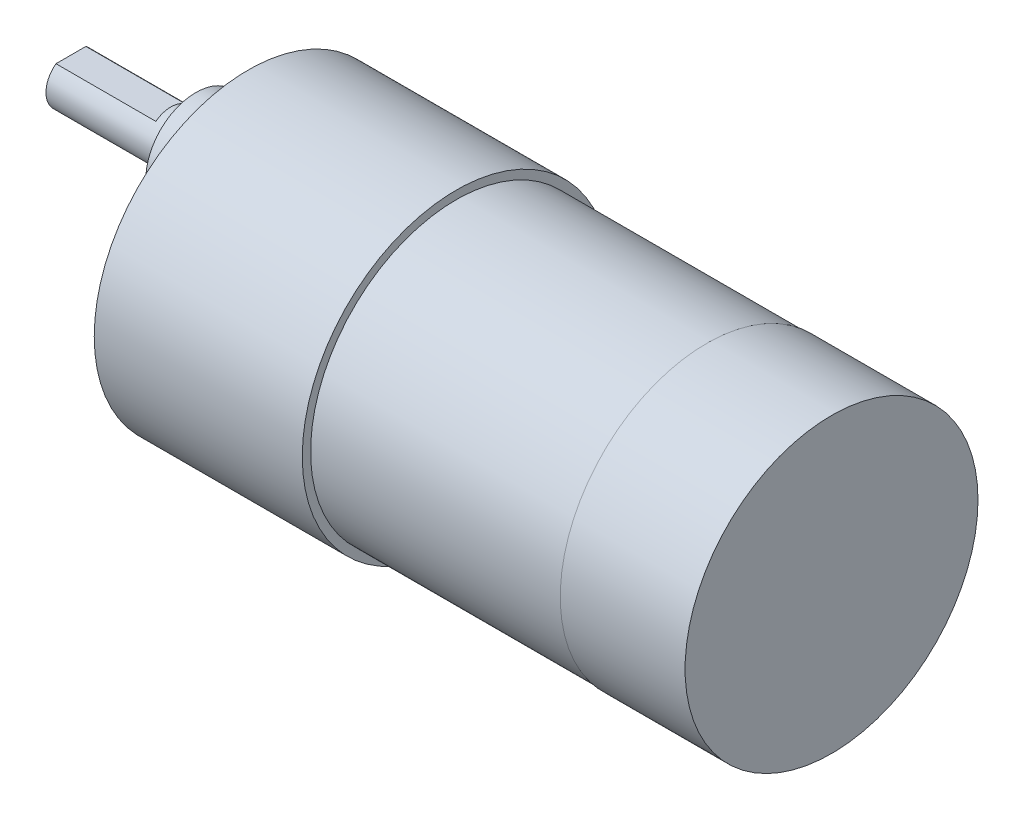
ISO-10303-21;
HEADER;
FILE_DESCRIPTION(('STEP AP214'),'2;1');
FILE_NAME('part.step','',(''),(''),'','','');
FILE_SCHEMA(('AUTOMOTIVE_DESIGN { 1 0 10303 214 1 1 1 1 }'));
ENDSEC;
DATA;
#1=APPLICATION_CONTEXT('core data for automotive mechanical design processes');
#2=APPLICATION_PROTOCOL_DEFINITION('international standard','automotive_design',2000,#1);
#3=PRODUCT_CONTEXT('',#1,'mechanical');
#4=PRODUCT('Part','Part','',(#3));
#5=PRODUCT_RELATED_PRODUCT_CATEGORY('part','',(#4));
#6=PRODUCT_DEFINITION_FORMATION('','',#4);
#7=PRODUCT_DEFINITION_CONTEXT('part definition',#1,'design');
#8=PRODUCT_DEFINITION('design','',#6,#7);
#9=PRODUCT_DEFINITION_SHAPE('','',#8);
#10=(LENGTH_UNIT() NAMED_UNIT(*) SI_UNIT(.MILLI.,.METRE.));
#11=(NAMED_UNIT(*) PLANE_ANGLE_UNIT() SI_UNIT($,.RADIAN.));
#12=(NAMED_UNIT(*) SI_UNIT($,.STERADIAN.) SOLID_ANGLE_UNIT());
#13=UNCERTAINTY_MEASURE_WITH_UNIT(LENGTH_MEASURE(1.E-05),#10,'distance_accuracy_value','');
#14=(GEOMETRIC_REPRESENTATION_CONTEXT(3) GLOBAL_UNCERTAINTY_ASSIGNED_CONTEXT((#13)) GLOBAL_UNIT_ASSIGNED_CONTEXT((#10,
#11,#12)) REPRESENTATION_CONTEXT('',''));
#15=CARTESIAN_POINT('',(0.,0.,0.));
#16=DIRECTION('',(0.,0.,1.));
#17=DIRECTION('',(1.,0.,0.));
#18=AXIS2_PLACEMENT_3D('',#15,#16,#17);
#19=CARTESIAN_POINT('',(204.237955952687,-13.875,0.));
#20=DIRECTION('',(1.,0.,0.));
#21=DIRECTION('',(0.,0.,-1.));
#22=AXIS2_PLACEMENT_3D('',#19,#20,#21);
#23=CYLINDRICAL_SURFACE('',#22,17.6);
#24=CARTESIAN_POINT('',(204.237955952687,-13.875,0.));
#25=DIRECTION('',(1.,0.,0.));
#26=DIRECTION('',(0.,0.,-1.));
#27=AXIS2_PLACEMENT_3D('',#24,#25,#26);
#28=CIRCLE('',#27,17.6);
#29=CARTESIAN_POINT('',(204.237955952687,-13.875,-17.6));
#30=VERTEX_POINT('',#29);
#31=EDGE_CURVE('E12',#30,#30,#28,.T.);
#32=ORIENTED_EDGE('',*,*,#31,.T.);
#33=EDGE_LOOP('',(#32));
#34=FACE_BOUND('',#33,.T.);
#35=CARTESIAN_POINT('',(219.237955952687,-13.875,0.));
#36=DIRECTION('',(1.,0.,0.));
#37=DIRECTION('',(0.,0.,-1.));
#38=AXIS2_PLACEMENT_3D('',#35,#36,#37);
#39=CIRCLE('',#38,17.6);
#40=CARTESIAN_POINT('',(219.237955952687,-13.875,-17.6));
#41=VERTEX_POINT('',#40);
#42=EDGE_CURVE('E47',#41,#41,#39,.T.);
#43=ORIENTED_EDGE('',*,*,#42,.F.);
#44=EDGE_LOOP('',(#43));
#45=FACE_BOUND('',#44,.T.);
#46=ADVANCED_FACE('F44',(#34,#45),#23,.T.);
#47=CARTESIAN_POINT('',(204.237955952687,-13.875,0.));
#48=DIRECTION('',(1.,0.,0.));
#49=DIRECTION('',(0.,0.,-1.));
#50=AXIS2_PLACEMENT_3D('',#47,#48,#49);
#51=PLANE('',#50);
#52=ORIENTED_EDGE('',*,*,#31,.F.);
#53=EDGE_LOOP('',(#52));
#54=FACE_BOUND('',#53,.T.);
#55=ADVANCED_FACE('F59',(#54),#51,.F.);
#56=CARTESIAN_POINT('',(219.237955952687,-13.875,0.));
#57=DIRECTION('',(1.,0.,0.));
#58=DIRECTION('',(0.,0.,-1.));
#59=AXIS2_PLACEMENT_3D('',#56,#57,#58);
#60=PLANE('',#59);
#61=ORIENTED_EDGE('',*,*,#42,.T.);
#62=EDGE_LOOP('',(#61));
#63=FACE_BOUND('',#62,.T.);
#64=ADVANCED_FACE('F56',(#63),#60,.T.);
#65=CLOSED_SHELL('',(#46,#55,#64));
#66=MANIFOLD_SOLID_BREP('B2',#65);
#67=CARTESIAN_POINT('',(219.137955952687,-13.875,0.));
#68=DIRECTION('',(-1.,0.,0.));
#69=DIRECTION('',(0.,0.,1.));
#70=AXIS2_PLACEMENT_3D('',#67,#68,#69);
#71=CYLINDRICAL_SURFACE('',#70,18.5);
#72=CARTESIAN_POINT('',(149.137955952687,-13.875,0.));
#73=DIRECTION('',(1.,0.,0.));
#74=DIRECTION('',(0.,0.,-1.));
#75=AXIS2_PLACEMENT_3D('',#72,#73,#74);
#76=CIRCLE('',#75,18.5);
#77=CARTESIAN_POINT('',(149.137955952687,-13.875,-18.5));
#78=VERTEX_POINT('',#77);
#79=EDGE_CURVE('E93',#78,#78,#76,.T.);
#80=ORIENTED_EDGE('',*,*,#79,.T.);
#81=EDGE_LOOP('',(#80));
#82=FACE_BOUND('',#81,.T.);
#83=CARTESIAN_POINT('',(174.137955952687,-13.875,0.));
#84=DIRECTION('',(1.,0.,0.));
#85=DIRECTION('',(0.,0.,-1.));
#86=AXIS2_PLACEMENT_3D('',#83,#84,#85);
#87=CIRCLE('',#86,18.5);
#88=CARTESIAN_POINT('',(174.137955952687,-13.875,-18.5));
#89=VERTEX_POINT('',#88);
#90=EDGE_CURVE('E88',#89,#89,#87,.T.);
#91=ORIENTED_EDGE('',*,*,#90,.F.);
#92=EDGE_LOOP('',(#91));
#93=FACE_BOUND('',#92,.T.);
#94=ADVANCED_FACE('F85',(#82,#93),#71,.T.);
#95=CARTESIAN_POINT('',(149.137955952687,-13.875,0.));
#96=DIRECTION('',(1.,0.,0.));
#97=DIRECTION('',(0.,0.,-1.));
#98=AXIS2_PLACEMENT_3D('',#95,#96,#97);
#99=PLANE('',#98);
#100=CARTESIAN_POINT('',(149.137955952687,-13.875,-15.5));
#101=DIRECTION('',(-1.,0.,0.));
#102=DIRECTION('',(0.,0.,1.));
#103=AXIS2_PLACEMENT_3D('',#100,#101,#102);
#104=CIRCLE('',#103,1.5);
#105=CARTESIAN_POINT('',(149.137955952687,-13.875,-14.));
#106=VERTEX_POINT('',#105);
#107=EDGE_CURVE('E257',#106,#106,#104,.T.);
#108=ORIENTED_EDGE('',*,*,#107,.F.);
#109=EDGE_LOOP('',(#108));
#110=FACE_BOUND('',#109,.T.);
#111=CARTESIAN_POINT('',(149.137955952687,-0.451606241341201,-7.74999999999999));
#112=DIRECTION('',(-1.,0.,0.));
#113=DIRECTION('',(0.,0.,1.));
#114=AXIS2_PLACEMENT_3D('',#111,#112,#113);
#115=CIRCLE('',#114,1.5);
#116=CARTESIAN_POINT('',(149.137955952687,-0.451606241341201,-6.24999999999999));
#117=VERTEX_POINT('',#116);
#118=EDGE_CURVE('E251',#117,#117,#115,.T.);
#119=ORIENTED_EDGE('',*,*,#118,.F.);
#120=EDGE_LOOP('',(#119));
#121=FACE_BOUND('',#120,.T.);
#122=CARTESIAN_POINT('',(149.137955952687,-0.451606241341213,7.75000000000001));
#123=DIRECTION('',(-1.,0.,0.));
#124=DIRECTION('',(0.,0.,1.));
#125=AXIS2_PLACEMENT_3D('',#122,#123,#124);
#126=CIRCLE('',#125,1.5);
#127=CARTESIAN_POINT('',(149.137955952687,-0.451606241341213,9.25000000000001));
#128=VERTEX_POINT('',#127);
#129=EDGE_CURVE('E245',#128,#128,#126,.T.);
#130=ORIENTED_EDGE('',*,*,#129,.F.);
#131=EDGE_LOOP('',(#130));
#132=FACE_BOUND('',#131,.T.);
#133=CARTESIAN_POINT('',(149.137955952687,-13.875,15.5));
#134=DIRECTION('',(-1.,0.,0.));
#135=DIRECTION('',(0.,0.,1.));
#136=AXIS2_PLACEMENT_3D('',#133,#134,#135);
#137=CIRCLE('',#136,1.5);
#138=CARTESIAN_POINT('',(149.137955952687,-13.875,17.));
#139=VERTEX_POINT('',#138);
#140=EDGE_CURVE('E244',#139,#139,#137,.T.);
#141=ORIENTED_EDGE('',*,*,#140,.F.);
#142=EDGE_LOOP('',(#141));
#143=FACE_BOUND('',#142,.T.);
#144=CARTESIAN_POINT('',(149.137955952687,-27.2983937586588,7.75));
#145=DIRECTION('',(-1.,0.,0.));
#146=DIRECTION('',(0.,0.,1.));
#147=AXIS2_PLACEMENT_3D('',#144,#145,#146);
#148=CIRCLE('',#147,1.5);
#149=CARTESIAN_POINT('',(149.137955952687,-27.2983937586588,9.25));
#150=VERTEX_POINT('',#149);
#151=EDGE_CURVE('E263',#150,#150,#148,.T.);
#152=ORIENTED_EDGE('',*,*,#151,.F.);
#153=EDGE_LOOP('',(#152));
#154=FACE_BOUND('',#153,.T.);
#155=CARTESIAN_POINT('',(149.137955952687,-27.2983937586588,-7.75));
#156=DIRECTION('',(-1.,0.,0.));
#157=DIRECTION('',(0.,0.,1.));
#158=AXIS2_PLACEMENT_3D('',#155,#156,#157);
#159=CIRCLE('',#158,1.5);
#160=CARTESIAN_POINT('',(149.137955952687,-27.2983937586588,-6.25));
#161=VERTEX_POINT('',#160);
#162=EDGE_CURVE('E135',#161,#161,#159,.T.);
#163=ORIENTED_EDGE('',*,*,#162,.F.);
#164=EDGE_LOOP('',(#163));
#165=FACE_BOUND('',#164,.T.);
#166=CARTESIAN_POINT('',(149.137955952687,-6.875,0.));
#167=DIRECTION('',(1.,0.,0.));
#168=DIRECTION('',(0.,0.,-1.));
#169=AXIS2_PLACEMENT_3D('',#166,#167,#168);
#170=CIRCLE('',#169,6.);
#171=CARTESIAN_POINT('',(149.137955952687,-6.875,-6.));
#172=VERTEX_POINT('',#171);
#173=EDGE_CURVE('E42',#172,#172,#170,.F.);
#174=ORIENTED_EDGE('',*,*,#173,.F.);
#175=EDGE_LOOP('',(#174));
#176=FACE_BOUND('',#175,.T.);
#177=ORIENTED_EDGE('',*,*,#79,.F.);
#178=EDGE_LOOP('',(#177));
#179=FACE_BOUND('',#178,.T.);
#180=ADVANCED_FACE('F143',(#110,#121,#132,#143,#154,#165,#176,#179),#99,.F.);
#181=CARTESIAN_POINT('',(142.837955952687,-6.875,0.));
#182=DIRECTION('',(1.,0.,0.));
#183=DIRECTION('',(0.,0.,-1.));
#184=AXIS2_PLACEMENT_3D('',#181,#182,#183);
#185=CYLINDRICAL_SURFACE('',#184,6.);
#186=CARTESIAN_POINT('',(142.837955952687,-6.875,0.));
#187=DIRECTION('',(-1.,0.,0.));
#188=DIRECTION('',(0.,0.,1.));
#189=AXIS2_PLACEMENT_3D('',#186,#187,#188);
#190=CIRCLE('',#189,6.);
#191=CARTESIAN_POINT('',(142.837955952687,-6.875,-6.));
#192=VERTEX_POINT('',#191);
#193=EDGE_CURVE('E126',#192,#192,#190,.T.);
#194=CARTESIAN_POINT('',(142.837955952687,-6.875,-6.));
#195=CARTESIAN_POINT('',(142.903580952687,-6.875,-6.));
#196=CARTESIAN_POINT('',(142.969205952687,-6.875,-6.));
#197=CARTESIAN_POINT('',(143.100455952687,-6.875,-6.));
#198=CARTESIAN_POINT('',(143.166080952687,-6.875,-6.));
#199=CARTESIAN_POINT('',(143.297330952687,-6.875,-6.));
#200=CARTESIAN_POINT('',(143.362955952687,-6.875,-6.));
#201=CARTESIAN_POINT('',(143.494205952687,-6.875,-6.));
#202=CARTESIAN_POINT('',(143.559830952687,-6.875,-6.));
#203=CARTESIAN_POINT('',(143.691080952687,-6.875,-6.));
#204=CARTESIAN_POINT('',(143.756705952687,-6.875,-6.));
#205=CARTESIAN_POINT('',(143.887955952687,-6.875,-6.));
#206=CARTESIAN_POINT('',(143.953580952687,-6.875,-6.));
#207=CARTESIAN_POINT('',(144.084830952687,-6.875,-6.));
#208=CARTESIAN_POINT('',(144.150455952687,-6.875,-6.));
#209=CARTESIAN_POINT('',(144.281705952687,-6.875,-6.));
#210=CARTESIAN_POINT('',(144.347330952687,-6.875,-6.));
#211=CARTESIAN_POINT('',(144.478580952687,-6.875,-6.));
#212=CARTESIAN_POINT('',(144.544205952687,-6.875,-6.));
#213=CARTESIAN_POINT('',(144.675455952687,-6.875,-6.));
#214=CARTESIAN_POINT('',(144.741080952687,-6.875,-6.));
#215=CARTESIAN_POINT('',(144.872330952687,-6.875,-6.));
#216=CARTESIAN_POINT('',(144.937955952687,-6.875,-6.));
#217=CARTESIAN_POINT('',(145.069205952687,-6.875,-6.));
#218=CARTESIAN_POINT('',(145.134830952687,-6.875,-6.));
#219=CARTESIAN_POINT('',(145.266080952687,-6.875,-6.));
#220=CARTESIAN_POINT('',(145.331705952687,-6.875,-6.));
#221=CARTESIAN_POINT('',(145.462955952687,-6.875,-6.));
#222=CARTESIAN_POINT('',(145.528580952687,-6.875,-6.));
#223=CARTESIAN_POINT('',(145.659830952687,-6.875,-6.));
#224=CARTESIAN_POINT('',(145.725455952687,-6.875,-6.));
#225=CARTESIAN_POINT('',(145.856705952687,-6.875,-6.));
#226=CARTESIAN_POINT('',(145.922330952687,-6.875,-6.));
#227=CARTESIAN_POINT('',(146.053580952687,-6.875,-6.));
#228=CARTESIAN_POINT('',(146.119205952687,-6.875,-6.));
#229=CARTESIAN_POINT('',(146.250455952687,-6.875,-6.));
#230=CARTESIAN_POINT('',(146.316080952687,-6.875,-6.));
#231=CARTESIAN_POINT('',(146.447330952687,-6.875,-6.));
#232=CARTESIAN_POINT('',(146.512955952687,-6.875,-6.));
#233=CARTESIAN_POINT('',(146.644205952687,-6.875,-6.));
#234=CARTESIAN_POINT('',(146.709830952687,-6.875,-6.));
#235=CARTESIAN_POINT('',(146.841080952687,-6.875,-6.));
#236=CARTESIAN_POINT('',(146.906705952687,-6.875,-6.));
#237=CARTESIAN_POINT('',(147.037955952687,-6.875,-6.));
#238=CARTESIAN_POINT('',(147.103580952687,-6.875,-6.));
#239=CARTESIAN_POINT('',(147.234830952687,-6.875,-6.));
#240=CARTESIAN_POINT('',(147.300455952687,-6.875,-6.));
#241=CARTESIAN_POINT('',(147.431705952687,-6.875,-6.));
#242=CARTESIAN_POINT('',(147.497330952687,-6.875,-6.));
#243=CARTESIAN_POINT('',(147.628580952687,-6.875,-6.));
#244=CARTESIAN_POINT('',(147.694205952687,-6.875,-6.));
#245=CARTESIAN_POINT('',(147.825455952687,-6.875,-6.));
#246=CARTESIAN_POINT('',(147.891080952687,-6.875,-6.));
#247=CARTESIAN_POINT('',(148.022330952687,-6.875,-6.));
#248=CARTESIAN_POINT('',(148.087955952687,-6.875,-6.));
#249=CARTESIAN_POINT('',(148.219205952687,-6.875,-6.));
#250=CARTESIAN_POINT('',(148.284830952687,-6.875,-6.));
#251=CARTESIAN_POINT('',(148.416080952687,-6.875,-6.));
#252=CARTESIAN_POINT('',(148.481705952687,-6.875,-6.));
#253=CARTESIAN_POINT('',(148.612955952687,-6.875,-6.));
#254=CARTESIAN_POINT('',(148.678580952687,-6.875,-6.));
#255=CARTESIAN_POINT('',(148.809830952687,-6.875,-6.));
#256=CARTESIAN_POINT('',(148.875455952687,-6.875,-6.));
#257=CARTESIAN_POINT('',(149.006705952687,-6.875,-6.));
#258=CARTESIAN_POINT('',(149.072330952687,-6.875,-6.));
#259=CARTESIAN_POINT('',(149.137955952687,-6.875,-6.));
#260=B_SPLINE_CURVE_WITH_KNOTS('',3,(#194,#195,#196,#197,#198,#199,#200,#201,#202,#203,#204,
#205,#206,#207,#208,#209,#210,#211,#212,#213,#214,#215,#216,#217,#218,#219,#220,#221,#222,#223,
#224,#225,#226,#227,#228,#229,#230,#231,#232,#233,#234,#235,#236,#237,#238,#239,#240,#241,#242,
#243,#244,#245,#246,#247,#248,#249,#250,#251,#252,#253,#254,#255,#256,#257,#258,#259),
.UNSPECIFIED.,.F.,.F.,(4,2,2,2,2,2,2,2,2,2,2,2,2,2,2,2,2,2,2,2,2,2,2,2,2,2,2,2,2,2,2,2,4),(0.,
0.196875000000013,0.393749999999998,0.590625000000011,0.787499999999997,0.98437500000001,
1.18124999999999,1.37812500000001,1.57499999999999,1.77187500000001,1.96874999999999,2.165625,
2.36249999999999,2.559375,2.75624999999999,2.953125,3.14999999999999,3.34687499999997,
3.54374999999998,3.74062499999997,3.93749999999998,4.13437499999997,4.33124999999998,
4.52812499999997,4.72499999999998,4.92187499999996,5.11874999999998,5.31562499999996,
5.51249999999998,5.70937499999996,5.90624999999997,6.10312499999996,6.29999999999994),.UNSPECIFIED.);
#261=EDGE_CURVE('BSEAM145',#192,#172,#260,.T.);
#262=ORIENTED_EDGE('',*,*,#193,.F.);
#263=ORIENTED_EDGE('',*,*,#173,.T.);
#264=ORIENTED_EDGE('',*,*,#261,.T.);
#265=ORIENTED_EDGE('',*,*,#261,.F.);
#266=EDGE_LOOP('',(#262,#264,#263,#265));
#267=FACE_BOUND('',#266,.T.);
#268=ADVANCED_FACE('F145',(#267),#185,.T.);
#269=CARTESIAN_POINT('',(142.837955952687,-6.875,0.));
#270=DIRECTION('',(-1.,0.,0.));
#271=DIRECTION('',(0.,0.,1.));
#272=AXIS2_PLACEMENT_3D('',#269,#270,#271);
#273=PLANE('',#272);
#274=CARTESIAN_POINT('',(142.837955952687,-6.875,0.));
#275=DIRECTION('',(-1.,0.,0.));
#276=DIRECTION('',(0.,0.,1.));
#277=AXIS2_PLACEMENT_3D('',#274,#275,#276);
#278=CIRCLE('',#277,3.00000000000016);
#279=CARTESIAN_POINT('',(142.837955952687,-6.875,3.00000000000016));
#280=VERTEX_POINT('',#279);
#281=EDGE_CURVE('E127',#280,#280,#278,.T.);
#282=ORIENTED_EDGE('',*,*,#281,.F.);
#283=EDGE_LOOP('',(#282));
#284=FACE_BOUND('',#283,.T.);
#285=ORIENTED_EDGE('',*,*,#193,.T.);
#286=EDGE_LOOP('',(#285));
#287=FACE_BOUND('',#286,.T.);
#288=ADVANCED_FACE('F151',(#284,#287),#273,.T.);
#289=CARTESIAN_POINT('',(127.837955952687,-6.875,0.));
#290=DIRECTION('',(1.,0.,0.));
#291=DIRECTION('',(0.,0.,-1.));
#292=AXIS2_PLACEMENT_3D('',#289,#290,#291);
#293=CYLINDRICAL_SURFACE('',#292,3.00000000000016);
#294=CARTESIAN_POINT('',(127.837955952687,-6.875,0.));
#295=DIRECTION('',(-1.,0.,0.));
#296=DIRECTION('',(0.,0.,1.));
#297=AXIS2_PLACEMENT_3D('',#294,#295,#296);
#298=CIRCLE('',#297,3.00000000000016);
#299=CARTESIAN_POINT('',(127.837955952687,-4.47500000000017,-1.80000000000049));
#300=VERTEX_POINT('',#299);
#301=CARTESIAN_POINT('',(127.837955952687,-4.47500000000017,1.80000000000049));
#302=VERTEX_POINT('',#301);
#303=EDGE_CURVE('E122',#300,#302,#298,.T.);
#304=ORIENTED_EDGE('',*,*,#303,.F.);
#305=DIRECTION('',(-1.,0.,0.));
#306=VECTOR('',#305,1.);
#307=CARTESIAN_POINT('',(139.837955952687,-4.47500000000017,-1.80000000000049));
#308=LINE('',#307,#306);
#309=CARTESIAN_POINT('',(139.837955952687,-4.47500000000017,-1.80000000000049));
#310=VERTEX_POINT('',#309);
#311=EDGE_CURVE('E100',#310,#300,#308,.T.);
#312=ORIENTED_EDGE('',*,*,#311,.F.);
#313=CARTESIAN_POINT('',(139.837955952687,-6.875,0.));
#314=DIRECTION('',(-1.,0.,0.));
#315=DIRECTION('',(0.,0.,1.));
#316=AXIS2_PLACEMENT_3D('',#313,#314,#315);
#317=CIRCLE('',#316,3.00000000000016);
#318=CARTESIAN_POINT('',(139.837955952687,-4.47500000000017,1.80000000000049));
#319=VERTEX_POINT('',#318);
#320=EDGE_CURVE('E116',#319,#310,#317,.T.);
#321=ORIENTED_EDGE('',*,*,#320,.F.);
#322=DIRECTION('',(-1.,0.,0.));
#323=VECTOR('',#322,1.);
#324=CARTESIAN_POINT('',(139.837955952687,-4.47500000000017,1.80000000000049));
#325=LINE('',#324,#323);
#326=EDGE_CURVE('E106',#319,#302,#325,.T.);
#327=ORIENTED_EDGE('',*,*,#326,.T.);
#328=EDGE_LOOP('',(#304,#312,#321,#327));
#329=FACE_BOUND('',#328,.T.);
#330=ORIENTED_EDGE('',*,*,#281,.T.);
#331=EDGE_LOOP('',(#330));
#332=FACE_BOUND('',#331,.T.);
#333=ADVANCED_FACE('F120',(#329,#332),#293,.T.);
#334=CARTESIAN_POINT('',(127.837955952687,-6.875,0.));
#335=DIRECTION('',(-1.,0.,0.));
#336=DIRECTION('',(0.,0.,1.));
#337=AXIS2_PLACEMENT_3D('',#334,#335,#336);
#338=PLANE('',#337);
#339=DIRECTION('',(0.,0.,1.));
#340=VECTOR('',#339,1.);
#341=CARTESIAN_POINT('',(127.837955952687,-4.47500000000017,0.));
#342=LINE('',#341,#340);
#343=EDGE_CURVE('E111',#300,#302,#342,.T.);
#344=ORIENTED_EDGE('',*,*,#343,.F.);
#345=ORIENTED_EDGE('',*,*,#303,.T.);
#346=EDGE_LOOP('',(#344,#345));
#347=FACE_BOUND('',#346,.T.);
#348=ADVANCED_FACE('F125',(#347),#338,.T.);
#349=CARTESIAN_POINT('',(169.137955952687,-27.2983937586588,-7.75));
#350=DIRECTION('',(-1.,0.,0.));
#351=DIRECTION('',(0.,0.,1.));
#352=AXIS2_PLACEMENT_3D('',#349,#350,#351);
#353=CYLINDRICAL_SURFACE('',#352,1.5);
#354=CARTESIAN_POINT('',(169.137955952687,-27.2983937586588,-7.75));
#355=DIRECTION('',(-1.,0.,0.));
#356=DIRECTION('',(0.,0.,1.));
#357=AXIS2_PLACEMENT_3D('',#354,#355,#356);
#358=CIRCLE('',#357,1.5);
#359=CARTESIAN_POINT('',(169.137955952687,-27.2983937586588,-6.25));
#360=VERTEX_POINT('',#359);
#361=EDGE_CURVE('E132',#360,#360,#358,.T.);
#362=ORIENTED_EDGE('',*,*,#361,.F.);
#363=EDGE_LOOP('',(#362));
#364=FACE_BOUND('',#363,.T.);
#365=ORIENTED_EDGE('',*,*,#162,.T.);
#366=EDGE_LOOP('',(#365));
#367=FACE_BOUND('',#366,.T.);
#368=ADVANCED_FACE('F169',(#364,#367),#353,.F.);
#369=CARTESIAN_POINT('',(169.137955952687,-27.2983937586588,-7.75));
#370=DIRECTION('',(-1.,0.,0.));
#371=DIRECTION('',(0.,0.,1.));
#372=AXIS2_PLACEMENT_3D('',#369,#370,#371);
#373=PLANE('',#372);
#374=ORIENTED_EDGE('',*,*,#361,.T.);
#375=EDGE_LOOP('',(#374));
#376=FACE_BOUND('',#375,.T.);
#377=ADVANCED_FACE('F172',(#376),#373,.T.);
#378=CARTESIAN_POINT('',(169.137955952687,-27.2983937586588,7.75));
#379=DIRECTION('',(-1.,0.,0.));
#380=DIRECTION('',(0.,0.,1.));
#381=AXIS2_PLACEMENT_3D('',#378,#379,#380);
#382=CYLINDRICAL_SURFACE('',#381,1.5);
#383=CARTESIAN_POINT('',(169.137955952687,-27.2983937586588,7.75));
#384=DIRECTION('',(-1.,0.,0.));
#385=DIRECTION('',(0.,0.,1.));
#386=AXIS2_PLACEMENT_3D('',#383,#384,#385);
#387=CIRCLE('',#386,1.5);
#388=CARTESIAN_POINT('',(169.137955952687,-27.2983937586588,9.25));
#389=VERTEX_POINT('',#388);
#390=EDGE_CURVE('E260',#389,#389,#387,.T.);
#391=ORIENTED_EDGE('',*,*,#390,.F.);
#392=EDGE_LOOP('',(#391));
#393=FACE_BOUND('',#392,.T.);
#394=ORIENTED_EDGE('',*,*,#151,.T.);
#395=EDGE_LOOP('',(#394));
#396=FACE_BOUND('',#395,.T.);
#397=ADVANCED_FACE('F176',(#393,#396),#382,.F.);
#398=CARTESIAN_POINT('',(169.137955952687,-27.2983937586588,7.75));
#399=DIRECTION('',(-1.,0.,0.));
#400=DIRECTION('',(0.,0.,1.));
#401=AXIS2_PLACEMENT_3D('',#398,#399,#400);
#402=PLANE('',#401);
#403=ORIENTED_EDGE('',*,*,#390,.T.);
#404=EDGE_LOOP('',(#403));
#405=FACE_BOUND('',#404,.T.);
#406=ADVANCED_FACE('F182',(#405),#402,.T.);
#407=CARTESIAN_POINT('',(169.137955952687,-13.875,15.5));
#408=DIRECTION('',(-1.,0.,0.));
#409=DIRECTION('',(0.,0.,1.));
#410=AXIS2_PLACEMENT_3D('',#407,#408,#409);
#411=CYLINDRICAL_SURFACE('',#410,1.5);
#412=CARTESIAN_POINT('',(169.137955952687,-13.875,15.5));
#413=DIRECTION('',(-1.,0.,0.));
#414=DIRECTION('',(0.,0.,1.));
#415=AXIS2_PLACEMENT_3D('',#412,#413,#414);
#416=CIRCLE('',#415,1.5);
#417=CARTESIAN_POINT('',(169.137955952687,-13.875,17.));
#418=VERTEX_POINT('',#417);
#419=EDGE_CURVE('E266',#418,#418,#416,.T.);
#420=ORIENTED_EDGE('',*,*,#419,.F.);
#421=EDGE_LOOP('',(#420));
#422=FACE_BOUND('',#421,.T.);
#423=ORIENTED_EDGE('',*,*,#140,.T.);
#424=EDGE_LOOP('',(#423));
#425=FACE_BOUND('',#424,.T.);
#426=ADVANCED_FACE('F178',(#422,#425),#411,.F.);
#427=CARTESIAN_POINT('',(169.137955952687,-13.875,15.5));
#428=DIRECTION('',(-1.,0.,0.));
#429=DIRECTION('',(0.,0.,1.));
#430=AXIS2_PLACEMENT_3D('',#427,#428,#429);
#431=PLANE('',#430);
#432=ORIENTED_EDGE('',*,*,#419,.T.);
#433=EDGE_LOOP('',(#432));
#434=FACE_BOUND('',#433,.T.);
#435=ADVANCED_FACE('F181',(#434),#431,.T.);
#436=CARTESIAN_POINT('',(169.137955952687,-0.451606241341213,7.75000000000001));
#437=DIRECTION('',(-1.,0.,0.));
#438=DIRECTION('',(0.,0.,1.));
#439=AXIS2_PLACEMENT_3D('',#436,#437,#438);
#440=CYLINDRICAL_SURFACE('',#439,1.5);
#441=CARTESIAN_POINT('',(169.137955952687,-0.451606241341213,7.75000000000001));
#442=DIRECTION('',(-1.,0.,0.));
#443=DIRECTION('',(0.,0.,1.));
#444=AXIS2_PLACEMENT_3D('',#441,#442,#443);
#445=CIRCLE('',#444,1.5);
#446=CARTESIAN_POINT('',(169.137955952687,-0.451606241341213,9.25000000000001));
#447=VERTEX_POINT('',#446);
#448=EDGE_CURVE('E241',#447,#447,#445,.T.);
#449=ORIENTED_EDGE('',*,*,#448,.F.);
#450=EDGE_LOOP('',(#449));
#451=FACE_BOUND('',#450,.T.);
#452=ORIENTED_EDGE('',*,*,#129,.T.);
#453=EDGE_LOOP('',(#452));
#454=FACE_BOUND('',#453,.T.);
#455=ADVANCED_FACE('F186',(#451,#454),#440,.F.);
#456=CARTESIAN_POINT('',(169.137955952687,-0.451606241341213,7.75000000000001));
#457=DIRECTION('',(-1.,0.,0.));
#458=DIRECTION('',(0.,0.,1.));
#459=AXIS2_PLACEMENT_3D('',#456,#457,#458);
#460=PLANE('',#459);
#461=ORIENTED_EDGE('',*,*,#448,.T.);
#462=EDGE_LOOP('',(#461));
#463=FACE_BOUND('',#462,.T.);
#464=ADVANCED_FACE('F207',(#463),#460,.T.);
#465=CARTESIAN_POINT('',(169.137955952687,-0.451606241341201,-7.74999999999999));
#466=DIRECTION('',(-1.,0.,0.));
#467=DIRECTION('',(0.,0.,1.));
#468=AXIS2_PLACEMENT_3D('',#465,#466,#467);
#469=CYLINDRICAL_SURFACE('',#468,1.5);
#470=CARTESIAN_POINT('',(169.137955952687,-0.451606241341201,-7.74999999999999));
#471=DIRECTION('',(-1.,0.,0.));
#472=DIRECTION('',(0.,0.,1.));
#473=AXIS2_PLACEMENT_3D('',#470,#471,#472);
#474=CIRCLE('',#473,1.5);
#475=CARTESIAN_POINT('',(169.137955952687,-0.451606241341201,-6.24999999999999));
#476=VERTEX_POINT('',#475);
#477=EDGE_CURVE('E248',#476,#476,#474,.T.);
#478=ORIENTED_EDGE('',*,*,#477,.F.);
#479=EDGE_LOOP('',(#478));
#480=FACE_BOUND('',#479,.T.);
#481=ORIENTED_EDGE('',*,*,#118,.T.);
#482=EDGE_LOOP('',(#481));
#483=FACE_BOUND('',#482,.T.);
#484=ADVANCED_FACE('F204',(#480,#483),#469,.F.);
#485=CARTESIAN_POINT('',(169.137955952687,-0.451606241341201,-7.74999999999999));
#486=DIRECTION('',(-1.,0.,0.));
#487=DIRECTION('',(0.,0.,1.));
#488=AXIS2_PLACEMENT_3D('',#485,#486,#487);
#489=PLANE('',#488);
#490=ORIENTED_EDGE('',*,*,#477,.T.);
#491=EDGE_LOOP('',(#490));
#492=FACE_BOUND('',#491,.T.);
#493=ADVANCED_FACE('F198',(#492),#489,.T.);
#494=CARTESIAN_POINT('',(169.137955952687,-13.875,-15.5));
#495=DIRECTION('',(-1.,0.,0.));
#496=DIRECTION('',(0.,0.,1.));
#497=AXIS2_PLACEMENT_3D('',#494,#495,#496);
#498=CYLINDRICAL_SURFACE('',#497,1.5);
#499=CARTESIAN_POINT('',(169.137955952687,-13.875,-15.5));
#500=DIRECTION('',(-1.,0.,0.));
#501=DIRECTION('',(0.,0.,1.));
#502=AXIS2_PLACEMENT_3D('',#499,#500,#501);
#503=CIRCLE('',#502,1.5);
#504=CARTESIAN_POINT('',(169.137955952687,-13.875,-14.));
#505=VERTEX_POINT('',#504);
#506=EDGE_CURVE('E254',#505,#505,#503,.T.);
#507=ORIENTED_EDGE('',*,*,#506,.F.);
#508=EDGE_LOOP('',(#507));
#509=FACE_BOUND('',#508,.T.);
#510=ORIENTED_EDGE('',*,*,#107,.T.);
#511=EDGE_LOOP('',(#510));
#512=FACE_BOUND('',#511,.T.);
#513=ADVANCED_FACE('F194',(#509,#512),#498,.F.);
#514=CARTESIAN_POINT('',(169.137955952687,-13.875,-15.5));
#515=DIRECTION('',(-1.,0.,0.));
#516=DIRECTION('',(0.,0.,1.));
#517=AXIS2_PLACEMENT_3D('',#514,#515,#516);
#518=PLANE('',#517);
#519=ORIENTED_EDGE('',*,*,#506,.T.);
#520=EDGE_LOOP('',(#519));
#521=FACE_BOUND('',#520,.T.);
#522=ADVANCED_FACE('F197',(#521),#518,.T.);
#523=CARTESIAN_POINT('',(174.137955952687,-13.875,0.));
#524=DIRECTION('',(1.,0.,0.));
#525=DIRECTION('',(0.,0.,-1.));
#526=AXIS2_PLACEMENT_3D('',#523,#524,#525);
#527=PLANE('',#526);
#528=CARTESIAN_POINT('',(174.137955952687,-13.875,0.));
#529=DIRECTION('',(1.,0.,0.));
#530=DIRECTION('',(0.,0.,-1.));
#531=AXIS2_PLACEMENT_3D('',#528,#529,#530);
#532=CIRCLE('',#531,17.5);
#533=CARTESIAN_POINT('',(174.137955952687,-13.875,-17.5));
#534=VERTEX_POINT('',#533);
#535=EDGE_CURVE('E236',#534,#534,#532,.T.);
#536=ORIENTED_EDGE('',*,*,#535,.F.);
#537=EDGE_LOOP('',(#536));
#538=FACE_BOUND('',#537,.T.);
#539=ORIENTED_EDGE('',*,*,#90,.T.);
#540=EDGE_LOOP('',(#539));
#541=FACE_BOUND('',#540,.T.);
#542=ADVANCED_FACE('F202',(#538,#541),#527,.T.);
#543=CARTESIAN_POINT('',(174.137955952687,-13.875,0.));
#544=DIRECTION('',(1.,0.,0.));
#545=DIRECTION('',(0.,0.,-1.));
#546=AXIS2_PLACEMENT_3D('',#543,#544,#545);
#547=CYLINDRICAL_SURFACE('',#546,17.5);
#548=CARTESIAN_POINT('',(219.137955952687,-13.875,0.));
#549=DIRECTION('',(1.,0.,0.));
#550=DIRECTION('',(0.,0.,-1.));
#551=AXIS2_PLACEMENT_3D('',#548,#549,#550);
#552=CIRCLE('',#551,17.5);
#553=CARTESIAN_POINT('',(219.137955952687,-13.875,-17.5));
#554=VERTEX_POINT('',#553);
#555=EDGE_CURVE('E123',#554,#554,#552,.T.);
#556=CARTESIAN_POINT('',(174.137955952687,-13.875,-17.5));
#557=CARTESIAN_POINT('',(174.606705952687,-13.875,-17.5));
#558=CARTESIAN_POINT('',(175.075455952687,-13.875,-17.5));
#559=CARTESIAN_POINT('',(176.012955952687,-13.875,-17.5));
#560=CARTESIAN_POINT('',(176.481705952687,-13.875,-17.5));
#561=CARTESIAN_POINT('',(177.419205952687,-13.875,-17.5));
#562=CARTESIAN_POINT('',(177.887955952687,-13.875,-17.5));
#563=CARTESIAN_POINT('',(178.825455952687,-13.875,-17.5));
#564=CARTESIAN_POINT('',(179.294205952687,-13.875,-17.5));
#565=CARTESIAN_POINT('',(180.231705952687,-13.875,-17.5));
#566=CARTESIAN_POINT('',(180.700455952687,-13.875,-17.5));
#567=CARTESIAN_POINT('',(181.637955952687,-13.875,-17.5));
#568=CARTESIAN_POINT('',(182.106705952687,-13.875,-17.5));
#569=CARTESIAN_POINT('',(183.044205952687,-13.875,-17.5));
#570=CARTESIAN_POINT('',(183.512955952687,-13.875,-17.5));
#571=CARTESIAN_POINT('',(184.450455952687,-13.875,-17.5));
#572=CARTESIAN_POINT('',(184.919205952687,-13.875,-17.5));
#573=CARTESIAN_POINT('',(185.856705952687,-13.875,-17.5));
#574=CARTESIAN_POINT('',(186.325455952687,-13.875,-17.5));
#575=CARTESIAN_POINT('',(187.262955952687,-13.875,-17.5));
#576=CARTESIAN_POINT('',(187.731705952687,-13.875,-17.5));
#577=CARTESIAN_POINT('',(188.669205952687,-13.875,-17.5));
#578=CARTESIAN_POINT('',(189.137955952687,-13.875,-17.5));
#579=CARTESIAN_POINT('',(190.075455952687,-13.875,-17.5));
#580=CARTESIAN_POINT('',(190.544205952687,-13.875,-17.5));
#581=CARTESIAN_POINT('',(191.481705952687,-13.875,-17.5));
#582=CARTESIAN_POINT('',(191.950455952687,-13.875,-17.5));
#583=CARTESIAN_POINT('',(192.887955952687,-13.875,-17.5));
#584=CARTESIAN_POINT('',(193.356705952687,-13.875,-17.5));
#585=CARTESIAN_POINT('',(194.294205952687,-13.875,-17.5));
#586=CARTESIAN_POINT('',(194.762955952687,-13.875,-17.5));
#587=CARTESIAN_POINT('',(195.700455952687,-13.875,-17.5));
#588=CARTESIAN_POINT('',(196.169205952687,-13.875,-17.5));
#589=CARTESIAN_POINT('',(197.106705952687,-13.875,-17.5));
#590=CARTESIAN_POINT('',(197.575455952687,-13.875,-17.5));
#591=CARTESIAN_POINT('',(198.512955952687,-13.875,-17.5));
#592=CARTESIAN_POINT('',(198.981705952687,-13.875,-17.5));
#593=CARTESIAN_POINT('',(199.919205952687,-13.875,-17.5));
#594=CARTESIAN_POINT('',(200.387955952687,-13.875,-17.5));
#595=CARTESIAN_POINT('',(201.325455952687,-13.875,-17.5));
#596=CARTESIAN_POINT('',(201.794205952687,-13.875,-17.5));
#597=CARTESIAN_POINT('',(202.731705952687,-13.875,-17.5));
#598=CARTESIAN_POINT('',(203.200455952687,-13.875,-17.5));
#599=CARTESIAN_POINT('',(204.137955952687,-13.875,-17.5));
#600=CARTESIAN_POINT('',(204.606705952687,-13.875,-17.5));
#601=CARTESIAN_POINT('',(205.544205952687,-13.875,-17.5));
#602=CARTESIAN_POINT('',(206.012955952687,-13.875,-17.5));
#603=CARTESIAN_POINT('',(206.950455952687,-13.875,-17.5));
#604=CARTESIAN_POINT('',(207.419205952687,-13.875,-17.5));
#605=CARTESIAN_POINT('',(208.356705952687,-13.875,-17.5));
#606=CARTESIAN_POINT('',(208.825455952687,-13.875,-17.5));
#607=CARTESIAN_POINT('',(209.762955952687,-13.875,-17.5));
#608=CARTESIAN_POINT('',(210.231705952687,-13.875,-17.5));
#609=CARTESIAN_POINT('',(211.169205952687,-13.875,-17.5));
#610=CARTESIAN_POINT('',(211.637955952687,-13.875,-17.5));
#611=CARTESIAN_POINT('',(212.575455952687,-13.875,-17.5));
#612=CARTESIAN_POINT('',(213.044205952687,-13.875,-17.5));
#613=CARTESIAN_POINT('',(213.981705952687,-13.875,-17.5));
#614=CARTESIAN_POINT('',(214.450455952687,-13.875,-17.5));
#615=CARTESIAN_POINT('',(215.387955952687,-13.875,-17.5));
#616=CARTESIAN_POINT('',(215.856705952687,-13.875,-17.5));
#617=CARTESIAN_POINT('',(216.794205952687,-13.875,-17.5));
#618=CARTESIAN_POINT('',(217.262955952687,-13.875,-17.5));
#619=CARTESIAN_POINT('',(218.200455952687,-13.875,-17.5));
#620=CARTESIAN_POINT('',(218.669205952687,-13.875,-17.5));
#621=CARTESIAN_POINT('',(219.137955952687,-13.875,-17.5));
#622=B_SPLINE_CURVE_WITH_KNOTS('',3,(#556,#557,#558,#559,#560,#561,#562,#563,#564,#565,#566,
#567,#568,#569,#570,#571,#572,#573,#574,#575,#576,#577,#578,#579,#580,#581,#582,#583,#584,#585,
#586,#587,#588,#589,#590,#591,#592,#593,#594,#595,#596,#597,#598,#599,#600,#601,#602,#603,#604,
#605,#606,#607,#608,#609,#610,#611,#612,#613,#614,#615,#616,#617,#618,#619,#620,#621),
.UNSPECIFIED.,.F.,.F.,(4,2,2,2,2,2,2,2,2,2,2,2,2,2,2,2,2,2,2,2,2,2,2,2,2,2,2,2,2,2,2,2,4),(0.,
1.40625000000003,2.81250000000002,4.21875000000002,5.62500000000002,7.03125000000002,
8.43750000000001,9.84375000000001,11.25,12.65625,14.0625,15.46875,16.875,18.28125,19.6875,
21.09375,22.5,23.90625,25.3125,26.71875,28.125,29.53125,30.9375,32.34375,33.75,35.15625,36.5625,
37.96875,39.375,40.78125,42.1875,43.59375,45.),.UNSPECIFIED.);
#623=EDGE_CURVE('BSEAM159',#534,#554,#622,.T.);
#624=ORIENTED_EDGE('',*,*,#535,.T.);
#625=ORIENTED_EDGE('',*,*,#555,.F.);
#626=ORIENTED_EDGE('',*,*,#623,.T.);
#627=ORIENTED_EDGE('',*,*,#623,.F.);
#628=EDGE_LOOP('',(#624,#626,#625,#627));
#629=FACE_BOUND('',#628,.T.);
#630=ADVANCED_FACE('F159',(#629),#547,.T.);
#631=CARTESIAN_POINT('',(219.137955952687,-13.875,0.));
#632=DIRECTION('',(1.,0.,0.));
#633=DIRECTION('',(0.,0.,-1.));
#634=AXIS2_PLACEMENT_3D('',#631,#632,#633);
#635=PLANE('',#634);
#636=ORIENTED_EDGE('',*,*,#555,.T.);
#637=EDGE_LOOP('',(#636));
#638=FACE_BOUND('',#637,.T.);
#639=ADVANCED_FACE('F157',(#638),#635,.T.);
#640=CARTESIAN_POINT('',(139.837955952687,-4.47500000000017,0.));
#641=DIRECTION('',(0.,-1.,0.));
#642=DIRECTION('',(0.,0.,-1.));
#643=AXIS2_PLACEMENT_3D('',#640,#641,#642);
#644=PLANE('',#643);
#645=ORIENTED_EDGE('',*,*,#343,.T.);
#646=ORIENTED_EDGE('',*,*,#326,.F.);
#647=DIRECTION('',(0.,0.,1.));
#648=VECTOR('',#647,1.);
#649=CARTESIAN_POINT('',(139.837955952687,-4.47500000000017,0.));
#650=LINE('',#649,#648);
#651=EDGE_CURVE('E231',#310,#319,#650,.T.);
#652=ORIENTED_EDGE('',*,*,#651,.F.);
#653=ORIENTED_EDGE('',*,*,#311,.T.);
#654=EDGE_LOOP('',(#645,#646,#652,#653));
#655=FACE_BOUND('',#654,.T.);
#656=ADVANCED_FACE('F112',(#655),#644,.F.);
#657=CARTESIAN_POINT('',(139.837955952687,0.,0.));
#658=DIRECTION('',(-1.,0.,0.));
#659=DIRECTION('',(0.,0.,1.));
#660=AXIS2_PLACEMENT_3D('',#657,#658,#659);
#661=PLANE('',#660);
#662=ORIENTED_EDGE('',*,*,#320,.T.);
#663=ORIENTED_EDGE('',*,*,#651,.T.);
#664=EDGE_LOOP('',(#662,#663));
#665=FACE_BOUND('',#664,.T.);
#666=ADVANCED_FACE('F226',(#665),#661,.T.);
#667=CLOSED_SHELL('',(#94,#180,#268,#288,#333,#348,#368,#377,#397,#406,#426,#435,#455,#464,#484,
#493,#513,#522,#542,#630,#639,#656,#666));
#668=MANIFOLD_SOLID_BREP('B7',#667);
#669=ADVANCED_BREP_SHAPE_REPRESENTATION('',(#18,#66,#668),#14);
#670=SHAPE_DEFINITION_REPRESENTATION(#9,#669);
ENDSEC;
END-ISO-10303-21;
